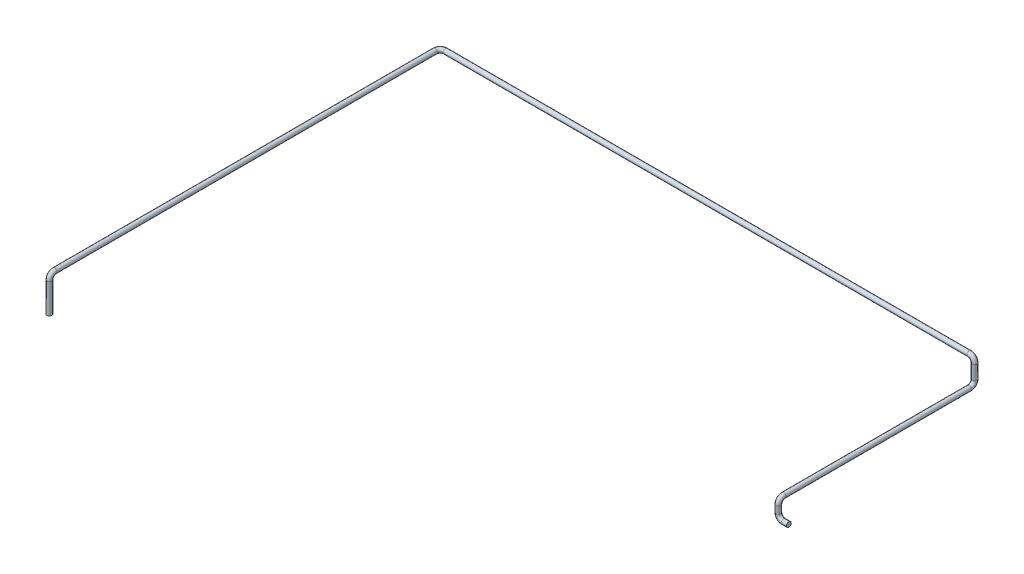
ISO-10303-21;
HEADER;
FILE_DESCRIPTION(('STEP AP214'),'2;1');
FILE_NAME('part.step','',(''),(''),'','','');
FILE_SCHEMA(('AUTOMOTIVE_DESIGN { 1 0 10303 214 1 1 1 1 }'));
ENDSEC;
DATA;
#1=APPLICATION_CONTEXT('core data for automotive mechanical design processes');
#2=APPLICATION_PROTOCOL_DEFINITION('international standard','automotive_design',2000,#1);
#3=PRODUCT_CONTEXT('',#1,'mechanical');
#4=PRODUCT('Part','Part','',(#3));
#5=PRODUCT_RELATED_PRODUCT_CATEGORY('part','',(#4));
#6=PRODUCT_DEFINITION_FORMATION('','',#4);
#7=PRODUCT_DEFINITION_CONTEXT('part definition',#1,'design');
#8=PRODUCT_DEFINITION('design','',#6,#7);
#9=PRODUCT_DEFINITION_SHAPE('','',#8);
#10=(LENGTH_UNIT() NAMED_UNIT(*) SI_UNIT(.MILLI.,.METRE.));
#11=(NAMED_UNIT(*) PLANE_ANGLE_UNIT() SI_UNIT($,.RADIAN.));
#12=(NAMED_UNIT(*) SI_UNIT($,.STERADIAN.) SOLID_ANGLE_UNIT());
#13=UNCERTAINTY_MEASURE_WITH_UNIT(LENGTH_MEASURE(1.E-05),#10,'distance_accuracy_value','');
#14=(GEOMETRIC_REPRESENTATION_CONTEXT(3) GLOBAL_UNCERTAINTY_ASSIGNED_CONTEXT((#13)) GLOBAL_UNIT_ASSIGNED_CONTEXT((#10,
#11,#12)) REPRESENTATION_CONTEXT('',''));
#15=CARTESIAN_POINT('',(0.,0.,0.));
#16=DIRECTION('',(0.,0.,1.));
#17=DIRECTION('',(1.,0.,0.));
#18=AXIS2_PLACEMENT_3D('',#15,#16,#17);
#19=CARTESIAN_POINT('',(0.,0.,0.));
#20=DIRECTION('',(1.,0.,0.));
#21=DIRECTION('',(0.,0.,-1.));
#22=AXIS2_PLACEMENT_3D('',#19,#20,#21);
#23=PLANE('',#22);
#24=CARTESIAN_POINT('',(0.,0.,0.));
#25=DIRECTION('',(1.,0.,0.));
#26=DIRECTION('',(0.,0.,-1.));
#27=AXIS2_PLACEMENT_3D('',#24,#25,#26);
#28=CIRCLE('',#27,13.7);
#29=CARTESIAN_POINT('',(0.,0.,-13.7));
#30=VERTEX_POINT('',#29);
#31=EDGE_CURVE('E47',#30,#30,#28,.T.);
#32=ORIENTED_EDGE('',*,*,#31,.T.);
#33=EDGE_LOOP('',(#32));
#34=FACE_BOUND('',#33,.T.);
#35=ADVANCED_FACE('F35',(#34),#23,.T.);
#36=CARTESIAN_POINT('',(-3110.,40.,1110.));
#37=DIRECTION('',(0.,1.,0.));
#38=DIRECTION('',(-1.,0.,0.));
#39=AXIS2_PLACEMENT_3D('',#36,#37,#38);
#40=PLANE('',#39);
#41=CARTESIAN_POINT('',(-3110.,40.,1110.));
#42=DIRECTION('',(0.,1.,0.));
#43=DIRECTION('',(-1.,0.,0.));
#44=AXIS2_PLACEMENT_3D('',#41,#42,#43);
#45=CIRCLE('',#44,13.7);
#46=CARTESIAN_POINT('',(-3123.7,40.,1110.));
#47=VERTEX_POINT('',#46);
#48=EDGE_CURVE('E11',#47,#47,#45,.T.);
#49=ORIENTED_EDGE('',*,*,#48,.F.);
#50=EDGE_LOOP('',(#49));
#51=FACE_BOUND('',#50,.T.);
#52=ADVANCED_FACE('F53',(#51),#40,.F.);
#53=CARTESIAN_POINT('',(0.,0.,0.));
#54=DIRECTION('',(-1.,0.,0.));
#55=DIRECTION('',(0.,0.,1.));
#56=AXIS2_PLACEMENT_3D('',#53,#54,#55);
#57=CYLINDRICAL_SURFACE('',#56,13.7);
#58=CARTESIAN_POINT('',(-30.,0.,0.));
#59=DIRECTION('',(1.,0.,0.));
#60=DIRECTION('',(0.,0.,-1.));
#61=AXIS2_PLACEMENT_3D('',#58,#59,#60);
#62=CIRCLE('',#61,13.7);
#63=CARTESIAN_POINT('',(-30.,-13.7,0.));
#64=VERTEX_POINT('',#63);
#65=EDGE_CURVE('E119',#64,#64,#62,.T.);
#66=ORIENTED_EDGE('',*,*,#65,.T.);
#67=EDGE_LOOP('',(#66));
#68=FACE_BOUND('',#67,.T.);
#69=ORIENTED_EDGE('',*,*,#31,.F.);
#70=EDGE_LOOP('',(#69));
#71=FACE_BOUND('',#70,.T.);
#72=ADVANCED_FACE('F55',(#68,#71),#57,.T.);
#73=CARTESIAN_POINT('',(-30.,30.,0.));
#74=DIRECTION('',(0.,0.,-1.));
#75=DIRECTION('',(-1.,0.,0.));
#76=AXIS2_PLACEMENT_3D('',#73,#74,#75);
#77=TOROIDAL_SURFACE('',#76,30.,13.7);
#78=CARTESIAN_POINT('',(-60.,30.,0.));
#79=DIRECTION('',(0.,-1.,0.));
#80=DIRECTION('',(0.,0.,-1.));
#81=AXIS2_PLACEMENT_3D('',#78,#79,#80);
#82=CIRCLE('',#81,13.7);
#83=CARTESIAN_POINT('',(-73.7,30.,0.));
#84=VERTEX_POINT('',#83);
#85=EDGE_CURVE('E116',#84,#84,#82,.T.);
#86=CARTESIAN_POINT('',(-30.,30.,0.));
#87=DIRECTION('',(0.,0.,-1.));
#88=DIRECTION('',(-1.,0.,0.));
#89=AXIS2_PLACEMENT_3D('',#86,#87,#88);
#90=CIRCLE('',#89,43.7);
#91=EDGE_CURVE('',#64,#84,#90,.T.);
#92=ORIENTED_EDGE('',*,*,#65,.F.);
#93=ORIENTED_EDGE('',*,*,#85,.T.);
#94=ORIENTED_EDGE('',*,*,#91,.T.);
#95=ORIENTED_EDGE('',*,*,#91,.F.);
#96=EDGE_LOOP('',(#92,#94,#93,#95));
#97=FACE_BOUND('',#96,.T.);
#98=ADVANCED_FACE('F60',(#97),#77,.T.);
#99=CARTESIAN_POINT('',(-60.,30.,0.));
#100=DIRECTION('',(0.,1.,0.));
#101=DIRECTION('',(0.,0.,1.));
#102=AXIS2_PLACEMENT_3D('',#99,#100,#101);
#103=CYLINDRICAL_SURFACE('',#102,13.7);
#104=CARTESIAN_POINT('',(-60.,70.,0.));
#105=DIRECTION('',(0.,-1.,0.));
#106=DIRECTION('',(0.,0.,-1.));
#107=AXIS2_PLACEMENT_3D('',#104,#105,#106);
#108=CIRCLE('',#107,13.7);
#109=CARTESIAN_POINT('',(-60.,70.,13.7));
#110=VERTEX_POINT('',#109);
#111=EDGE_CURVE('E121',#110,#110,#108,.T.);
#112=ORIENTED_EDGE('',*,*,#111,.T.);
#113=EDGE_LOOP('',(#112));
#114=FACE_BOUND('',#113,.T.);
#115=ORIENTED_EDGE('',*,*,#85,.F.);
#116=EDGE_LOOP('',(#115));
#117=FACE_BOUND('',#116,.T.);
#118=ADVANCED_FACE('F104',(#114,#117),#103,.T.);
#119=CARTESIAN_POINT('',(-60.,70.,-30.));
#120=DIRECTION('',(-1.,0.,0.));
#121=DIRECTION('',(0.,0.,1.));
#122=AXIS2_PLACEMENT_3D('',#119,#120,#121);
#123=TOROIDAL_SURFACE('',#122,30.,13.7);
#124=CARTESIAN_POINT('',(-60.,100.,-30.));
#125=DIRECTION('',(0.,0.,1.));
#126=DIRECTION('',(0.,-1.,0.));
#127=AXIS2_PLACEMENT_3D('',#124,#125,#126);
#128=CIRCLE('',#127,13.7);
#129=CARTESIAN_POINT('',(-60.,113.7,-30.));
#130=VERTEX_POINT('',#129);
#131=EDGE_CURVE('E127',#130,#130,#128,.T.);
#132=CARTESIAN_POINT('',(-60.,70.,-30.));
#133=DIRECTION('',(-1.,0.,0.));
#134=DIRECTION('',(0.,0.,1.));
#135=AXIS2_PLACEMENT_3D('',#132,#133,#134);
#136=CIRCLE('',#135,43.7);
#137=EDGE_CURVE('',#110,#130,#136,.T.);
#138=ORIENTED_EDGE('',*,*,#111,.F.);
#139=ORIENTED_EDGE('',*,*,#131,.T.);
#140=ORIENTED_EDGE('',*,*,#137,.T.);
#141=ORIENTED_EDGE('',*,*,#137,.F.);
#142=EDGE_LOOP('',(#138,#140,#139,#141));
#143=FACE_BOUND('',#142,.T.);
#144=ADVANCED_FACE('F100',(#143),#123,.T.);
#145=CARTESIAN_POINT('',(-60.,100.,-30.));
#146=DIRECTION('',(0.,0.,-1.));
#147=DIRECTION('',(-1.,0.,0.));
#148=AXIS2_PLACEMENT_3D('',#145,#146,#147);
#149=CYLINDRICAL_SURFACE('',#148,13.7);
#150=CARTESIAN_POINT('',(-60.0000000000001,100.,-1090.));
#151=DIRECTION('',(0.,0.,1.));
#152=DIRECTION('',(0.,-1.,0.));
#153=AXIS2_PLACEMENT_3D('',#150,#151,#152);
#154=CIRCLE('',#153,13.7);
#155=CARTESIAN_POINT('',(-60.0000000000001,86.3,-1090.));
#156=VERTEX_POINT('',#155);
#157=EDGE_CURVE('E130',#156,#156,#154,.T.);
#158=ORIENTED_EDGE('',*,*,#157,.T.);
#159=EDGE_LOOP('',(#158));
#160=FACE_BOUND('',#159,.T.);
#161=ORIENTED_EDGE('',*,*,#131,.F.);
#162=EDGE_LOOP('',(#161));
#163=FACE_BOUND('',#162,.T.);
#164=ADVANCED_FACE('F96',(#160,#163),#149,.T.);
#165=CARTESIAN_POINT('',(-60.,130.,-1090.));
#166=DIRECTION('',(1.,0.,0.));
#167=DIRECTION('',(0.,0.,-1.));
#168=AXIS2_PLACEMENT_3D('',#165,#166,#167);
#169=TOROIDAL_SURFACE('',#168,30.,13.7);
#170=CARTESIAN_POINT('',(-60.,130.,-1120.));
#171=DIRECTION('',(0.,-1.,0.));
#172=DIRECTION('',(0.,0.,-1.));
#173=AXIS2_PLACEMENT_3D('',#170,#171,#172);
#174=CIRCLE('',#173,13.7);
#175=CARTESIAN_POINT('',(-60.,130.,-1133.7));
#176=VERTEX_POINT('',#175);
#177=EDGE_CURVE('E133',#176,#176,#174,.T.);
#178=CARTESIAN_POINT('',(-60.,130.,-1090.));
#179=DIRECTION('',(1.,0.,0.));
#180=DIRECTION('',(0.,0.,-1.));
#181=AXIS2_PLACEMENT_3D('',#178,#179,#180);
#182=CIRCLE('',#181,43.7);
#183=EDGE_CURVE('',#156,#176,#182,.T.);
#184=ORIENTED_EDGE('',*,*,#157,.F.);
#185=ORIENTED_EDGE('',*,*,#177,.T.);
#186=ORIENTED_EDGE('',*,*,#183,.T.);
#187=ORIENTED_EDGE('',*,*,#183,.F.);
#188=EDGE_LOOP('',(#184,#186,#185,#187));
#189=FACE_BOUND('',#188,.T.);
#190=ADVANCED_FACE('F92',(#189),#169,.T.);
#191=CARTESIAN_POINT('',(-60.0000000000001,130.,-1120.));
#192=DIRECTION('',(0.,1.,0.));
#193=DIRECTION('',(-1.,0.,0.));
#194=AXIS2_PLACEMENT_3D('',#191,#192,#193);
#195=CYLINDRICAL_SURFACE('',#194,13.7);
#196=CARTESIAN_POINT('',(-60.0000000000001,210.,-1120.));
#197=DIRECTION('',(0.,-1.,0.));
#198=DIRECTION('',(0.,0.,-1.));
#199=AXIS2_PLACEMENT_3D('',#196,#197,#198);
#200=CIRCLE('',#199,13.7);
#201=CARTESIAN_POINT('',(-46.3000000000001,210.,-1120.));
#202=VERTEX_POINT('',#201);
#203=EDGE_CURVE('E136',#202,#202,#200,.T.);
#204=ORIENTED_EDGE('',*,*,#203,.T.);
#205=EDGE_LOOP('',(#204));
#206=FACE_BOUND('',#205,.T.);
#207=ORIENTED_EDGE('',*,*,#177,.F.);
#208=EDGE_LOOP('',(#207));
#209=FACE_BOUND('',#208,.T.);
#210=ADVANCED_FACE('F88',(#206,#209),#195,.T.);
#211=CARTESIAN_POINT('',(-90.0000000000001,210.,-1120.));
#212=DIRECTION('',(0.,0.,1.));
#213=DIRECTION('',(1.,0.,0.));
#214=AXIS2_PLACEMENT_3D('',#211,#212,#213);
#215=TOROIDAL_SURFACE('',#214,30.,13.7);
#216=CARTESIAN_POINT('',(-90.0000000000001,240.,-1120.));
#217=DIRECTION('',(1.,0.,0.));
#218=DIRECTION('',(0.,0.,-1.));
#219=AXIS2_PLACEMENT_3D('',#216,#217,#218);
#220=CIRCLE('',#219,13.7);
#221=CARTESIAN_POINT('',(-90.0000000000001,253.7,-1120.));
#222=VERTEX_POINT('',#221);
#223=EDGE_CURVE('E139',#222,#222,#220,.T.);
#224=CARTESIAN_POINT('',(-90.0000000000001,210.,-1120.));
#225=DIRECTION('',(0.,0.,1.));
#226=DIRECTION('',(1.,0.,0.));
#227=AXIS2_PLACEMENT_3D('',#224,#225,#226);
#228=CIRCLE('',#227,43.7);
#229=EDGE_CURVE('',#202,#222,#228,.T.);
#230=ORIENTED_EDGE('',*,*,#203,.F.);
#231=ORIENTED_EDGE('',*,*,#223,.T.);
#232=ORIENTED_EDGE('',*,*,#229,.T.);
#233=ORIENTED_EDGE('',*,*,#229,.F.);
#234=EDGE_LOOP('',(#230,#232,#231,#233));
#235=FACE_BOUND('',#234,.T.);
#236=ADVANCED_FACE('F84',(#235),#215,.T.);
#237=CARTESIAN_POINT('',(-90.0000000000001,240.,-1120.));
#238=DIRECTION('',(-1.,0.,0.));
#239=DIRECTION('',(0.,0.,1.));
#240=AXIS2_PLACEMENT_3D('',#237,#238,#239);
#241=CYLINDRICAL_SURFACE('',#240,13.7);
#242=CARTESIAN_POINT('',(-3080.,240.,-1120.));
#243=DIRECTION('',(1.,0.,0.));
#244=DIRECTION('',(0.,0.,-1.));
#245=AXIS2_PLACEMENT_3D('',#242,#243,#244);
#246=CIRCLE('',#245,13.7);
#247=CARTESIAN_POINT('',(-3080.,240.,-1133.7));
#248=VERTEX_POINT('',#247);
#249=EDGE_CURVE('E142',#248,#248,#246,.T.);
#250=ORIENTED_EDGE('',*,*,#249,.T.);
#251=EDGE_LOOP('',(#250));
#252=FACE_BOUND('',#251,.T.);
#253=ORIENTED_EDGE('',*,*,#223,.F.);
#254=EDGE_LOOP('',(#253));
#255=FACE_BOUND('',#254,.T.);
#256=ADVANCED_FACE('F80',(#252,#255),#241,.T.);
#257=CARTESIAN_POINT('',(-3080.,240.,-1090.));
#258=DIRECTION('',(0.,1.,0.));
#259=DIRECTION('',(0.,0.,1.));
#260=AXIS2_PLACEMENT_3D('',#257,#258,#259);
#261=TOROIDAL_SURFACE('',#260,30.,13.7);
#262=CARTESIAN_POINT('',(-3110.,240.,-1090.));
#263=DIRECTION('',(0.,0.,-1.));
#264=DIRECTION('',(-1.,0.,0.));
#265=AXIS2_PLACEMENT_3D('',#262,#263,#264);
#266=CIRCLE('',#265,13.7);
#267=CARTESIAN_POINT('',(-3123.7,240.,-1090.));
#268=VERTEX_POINT('',#267);
#269=EDGE_CURVE('E145',#268,#268,#266,.T.);
#270=CARTESIAN_POINT('',(-3080.,240.,-1090.));
#271=DIRECTION('',(0.,1.,0.));
#272=DIRECTION('',(0.,0.,1.));
#273=AXIS2_PLACEMENT_3D('',#270,#271,#272);
#274=CIRCLE('',#273,43.7);
#275=EDGE_CURVE('',#248,#268,#274,.T.);
#276=ORIENTED_EDGE('',*,*,#249,.F.);
#277=ORIENTED_EDGE('',*,*,#269,.T.);
#278=ORIENTED_EDGE('',*,*,#275,.T.);
#279=ORIENTED_EDGE('',*,*,#275,.F.);
#280=EDGE_LOOP('',(#276,#278,#277,#279));
#281=FACE_BOUND('',#280,.T.);
#282=ADVANCED_FACE('F76',(#281),#261,.T.);
#283=CARTESIAN_POINT('',(-3110.,240.,-1090.));
#284=DIRECTION('',(0.,0.,1.));
#285=DIRECTION('',(1.,0.,0.));
#286=AXIS2_PLACEMENT_3D('',#283,#284,#285);
#287=CYLINDRICAL_SURFACE('',#286,13.7);
#288=CARTESIAN_POINT('',(-3110.,240.,1080.));
#289=DIRECTION('',(0.,0.,-1.));
#290=DIRECTION('',(-1.,0.,0.));
#291=AXIS2_PLACEMENT_3D('',#288,#289,#290);
#292=CIRCLE('',#291,13.7);
#293=CARTESIAN_POINT('',(-3110.,253.7,1080.));
#294=VERTEX_POINT('',#293);
#295=EDGE_CURVE('E148',#294,#294,#292,.T.);
#296=ORIENTED_EDGE('',*,*,#295,.T.);
#297=EDGE_LOOP('',(#296));
#298=FACE_BOUND('',#297,.T.);
#299=ORIENTED_EDGE('',*,*,#269,.F.);
#300=EDGE_LOOP('',(#299));
#301=FACE_BOUND('',#300,.T.);
#302=ADVANCED_FACE('F70',(#298,#301),#287,.T.);
#303=CARTESIAN_POINT('',(-3110.,210.,1080.));
#304=DIRECTION('',(1.,0.,0.));
#305=DIRECTION('',(0.,0.,-1.));
#306=AXIS2_PLACEMENT_3D('',#303,#304,#305);
#307=TOROIDAL_SURFACE('',#306,30.,13.7);
#308=CARTESIAN_POINT('',(-3110.,210.,1110.));
#309=DIRECTION('',(0.,1.,0.));
#310=DIRECTION('',(-1.,0.,0.));
#311=AXIS2_PLACEMENT_3D('',#308,#309,#310);
#312=CIRCLE('',#311,13.7);
#313=CARTESIAN_POINT('',(-3110.,210.,1123.7));
#314=VERTEX_POINT('',#313);
#315=EDGE_CURVE('E42',#314,#314,#312,.T.);
#316=CARTESIAN_POINT('',(-3110.,210.,1080.));
#317=DIRECTION('',(1.,0.,0.));
#318=DIRECTION('',(0.,0.,-1.));
#319=AXIS2_PLACEMENT_3D('',#316,#317,#318);
#320=CIRCLE('',#319,43.7);
#321=EDGE_CURVE('',#294,#314,#320,.T.);
#322=ORIENTED_EDGE('',*,*,#295,.F.);
#323=ORIENTED_EDGE('',*,*,#315,.T.);
#324=ORIENTED_EDGE('',*,*,#321,.T.);
#325=ORIENTED_EDGE('',*,*,#321,.F.);
#326=EDGE_LOOP('',(#322,#324,#323,#325));
#327=FACE_BOUND('',#326,.T.);
#328=ADVANCED_FACE('F66',(#327),#307,.T.);
#329=CARTESIAN_POINT('',(-3110.,210.,1110.));
#330=DIRECTION('',(0.,-1.,0.));
#331=DIRECTION('',(0.,0.,-1.));
#332=AXIS2_PLACEMENT_3D('',#329,#330,#331);
#333=CYLINDRICAL_SURFACE('',#332,13.7);
#334=ORIENTED_EDGE('',*,*,#48,.T.);
#335=EDGE_LOOP('',(#334));
#336=FACE_BOUND('',#335,.T.);
#337=ORIENTED_EDGE('',*,*,#315,.F.);
#338=EDGE_LOOP('',(#337));
#339=FACE_BOUND('',#338,.T.);
#340=ADVANCED_FACE('F50',(#336,#339),#333,.T.);
#341=CLOSED_SHELL('',(#35,#52,#72,#98,#118,#144,#164,#190,#210,#236,#256,#282,#302,#328,#340));
#342=MANIFOLD_SOLID_BREP('B2',#341);
#343=ADVANCED_BREP_SHAPE_REPRESENTATION('',(#18,#342),#14);
#344=SHAPE_DEFINITION_REPRESENTATION(#9,#343);
ENDSEC;
END-ISO-10303-21;
